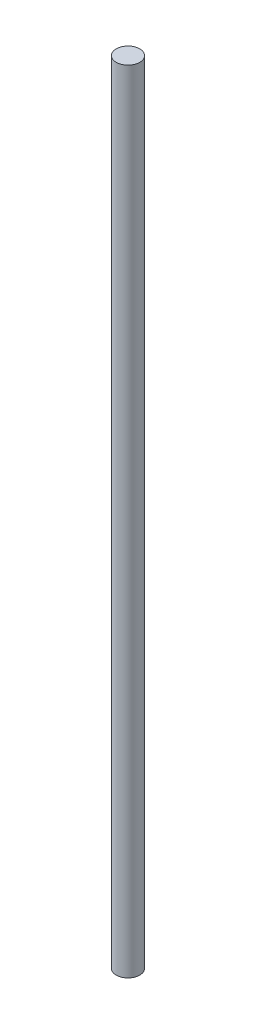
ISO-10303-21;
HEADER;
FILE_DESCRIPTION(('STEP AP214'),'2;1');
FILE_NAME('part.step','',(''),(''),'','','');
FILE_SCHEMA(('AUTOMOTIVE_DESIGN { 1 0 10303 214 1 1 1 1 }'));
ENDSEC;
DATA;
#1=APPLICATION_CONTEXT('core data for automotive mechanical design processes');
#2=APPLICATION_PROTOCOL_DEFINITION('international standard','automotive_design',2000,#1);
#3=PRODUCT_CONTEXT('',#1,'mechanical');
#4=PRODUCT('Part','Part','',(#3));
#5=PRODUCT_RELATED_PRODUCT_CATEGORY('part','',(#4));
#6=PRODUCT_DEFINITION_FORMATION('','',#4);
#7=PRODUCT_DEFINITION_CONTEXT('part definition',#1,'design');
#8=PRODUCT_DEFINITION('design','',#6,#7);
#9=PRODUCT_DEFINITION_SHAPE('','',#8);
#10=(LENGTH_UNIT() NAMED_UNIT(*) SI_UNIT(.MILLI.,.METRE.));
#11=(NAMED_UNIT(*) PLANE_ANGLE_UNIT() SI_UNIT($,.RADIAN.));
#12=(NAMED_UNIT(*) SI_UNIT($,.STERADIAN.) SOLID_ANGLE_UNIT());
#13=UNCERTAINTY_MEASURE_WITH_UNIT(LENGTH_MEASURE(1.E-05),#10,'distance_accuracy_value','');
#14=(GEOMETRIC_REPRESENTATION_CONTEXT(3) GLOBAL_UNCERTAINTY_ASSIGNED_CONTEXT((#13)) GLOBAL_UNIT_ASSIGNED_CONTEXT((#10,
#11,#12)) REPRESENTATION_CONTEXT('',''));
#15=CARTESIAN_POINT('',(0.,0.,0.));
#16=DIRECTION('',(0.,0.,1.));
#17=DIRECTION('',(1.,0.,0.));
#18=AXIS2_PLACEMENT_3D('',#15,#16,#17);
#19=CARTESIAN_POINT('',(0.,375.,0.));
#20=DIRECTION('',(0.,-1.,0.));
#21=DIRECTION('',(0.,0.,-1.));
#22=AXIS2_PLACEMENT_3D('',#19,#20,#21);
#23=CYLINDRICAL_SURFACE('',#22,5.55625);
#24=CARTESIAN_POINT('',(0.,375.,0.));
#25=DIRECTION('',(0.,1.,0.));
#26=DIRECTION('',(0.,0.,1.));
#27=AXIS2_PLACEMENT_3D('',#24,#25,#26);
#28=CIRCLE('',#27,5.55625);
#29=CARTESIAN_POINT('',(0.,375.,5.55625));
#30=VERTEX_POINT('',#29);
#31=EDGE_CURVE('E10',#30,#30,#28,.T.);
#32=ORIENTED_EDGE('',*,*,#31,.F.);
#33=EDGE_LOOP('',(#32));
#34=FACE_BOUND('',#33,.T.);
#35=CARTESIAN_POINT('',(0.,0.,0.));
#36=DIRECTION('',(0.,1.,0.));
#37=DIRECTION('',(0.,0.,1.));
#38=AXIS2_PLACEMENT_3D('',#35,#36,#37);
#39=CIRCLE('',#38,5.55625);
#40=CARTESIAN_POINT('',(0.,0.,5.55625));
#41=VERTEX_POINT('',#40);
#42=EDGE_CURVE('E42',#41,#41,#39,.T.);
#43=ORIENTED_EDGE('',*,*,#42,.T.);
#44=EDGE_LOOP('',(#43));
#45=FACE_BOUND('',#44,.T.);
#46=ADVANCED_FACE('F39',(#34,#45),#23,.T.);
#47=CARTESIAN_POINT('',(0.,375.,0.));
#48=DIRECTION('',(0.,1.,0.));
#49=DIRECTION('',(0.,0.,1.));
#50=AXIS2_PLACEMENT_3D('',#47,#48,#49);
#51=PLANE('',#50);
#52=ORIENTED_EDGE('',*,*,#31,.T.);
#53=EDGE_LOOP('',(#52));
#54=FACE_BOUND('',#53,.T.);
#55=ADVANCED_FACE('F54',(#54),#51,.T.);
#56=CARTESIAN_POINT('',(0.,0.,0.));
#57=DIRECTION('',(0.,1.,0.));
#58=DIRECTION('',(0.,0.,1.));
#59=AXIS2_PLACEMENT_3D('',#56,#57,#58);
#60=PLANE('',#59);
#61=ORIENTED_EDGE('',*,*,#42,.F.);
#62=EDGE_LOOP('',(#61));
#63=FACE_BOUND('',#62,.T.);
#64=ADVANCED_FACE('F52',(#63),#60,.F.);
#65=CLOSED_SHELL('',(#46,#55,#64));
#66=MANIFOLD_SOLID_BREP('B2',#65);
#67=ADVANCED_BREP_SHAPE_REPRESENTATION('',(#18,#66),#14);
#68=SHAPE_DEFINITION_REPRESENTATION(#9,#67);
ENDSEC;
END-ISO-10303-21;
